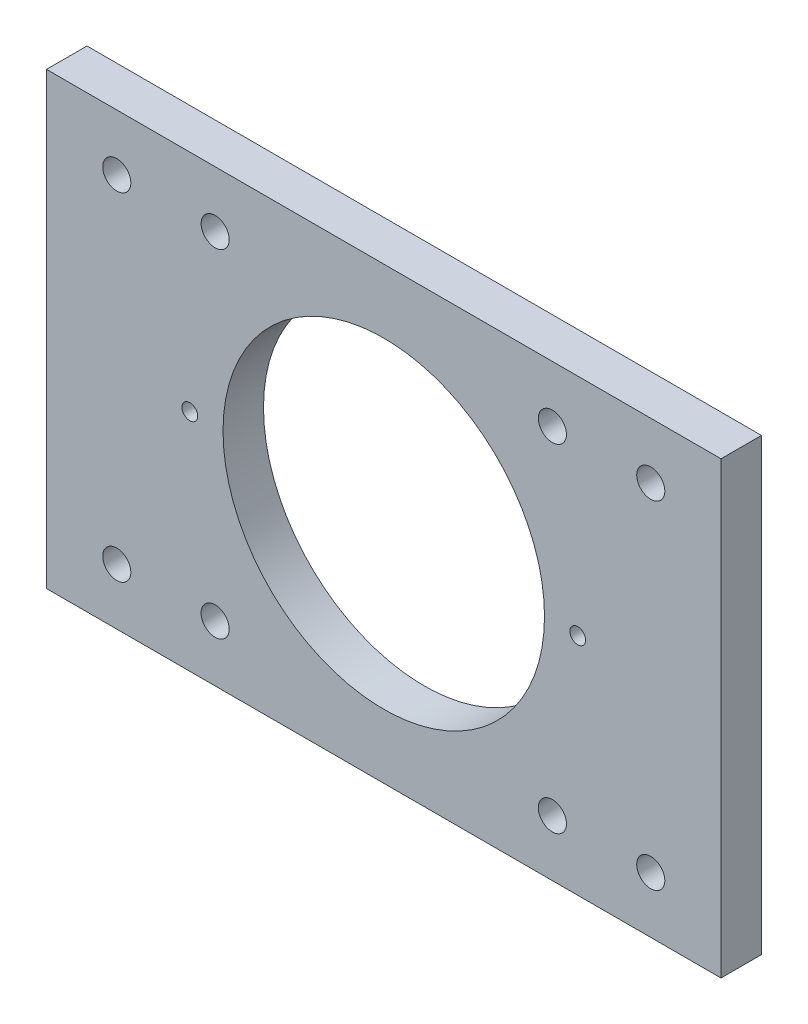
ISO-10303-21;
HEADER;
FILE_DESCRIPTION(('STEP AP214'),'2;1');
FILE_NAME('part.step','',(''),(''),'','','');
FILE_SCHEMA(('AUTOMOTIVE_DESIGN { 1 0 10303 214 1 1 1 1 }'));
ENDSEC;
DATA;
#1=APPLICATION_CONTEXT('core data for automotive mechanical design processes');
#2=APPLICATION_PROTOCOL_DEFINITION('international standard','automotive_design',2000,#1);
#3=PRODUCT_CONTEXT('',#1,'mechanical');
#4=PRODUCT('Part','Part','',(#3));
#5=PRODUCT_RELATED_PRODUCT_CATEGORY('part','',(#4));
#6=PRODUCT_DEFINITION_FORMATION('','',#4);
#7=PRODUCT_DEFINITION_CONTEXT('part definition',#1,'design');
#8=PRODUCT_DEFINITION('design','',#6,#7);
#9=PRODUCT_DEFINITION_SHAPE('','',#8);
#10=(LENGTH_UNIT() NAMED_UNIT(*) SI_UNIT(.MILLI.,.METRE.));
#11=(NAMED_UNIT(*) PLANE_ANGLE_UNIT() SI_UNIT($,.RADIAN.));
#12=(NAMED_UNIT(*) SI_UNIT($,.STERADIAN.) SOLID_ANGLE_UNIT());
#13=UNCERTAINTY_MEASURE_WITH_UNIT(LENGTH_MEASURE(1.E-05),#10,'distance_accuracy_value','');
#14=(GEOMETRIC_REPRESENTATION_CONTEXT(3) GLOBAL_UNCERTAINTY_ASSIGNED_CONTEXT((#13)) GLOBAL_UNIT_ASSIGNED_CONTEXT((#10,
#11,#12)) REPRESENTATION_CONTEXT('',''));
#15=CARTESIAN_POINT('',(0.,0.,0.));
#16=DIRECTION('',(0.,0.,1.));
#17=DIRECTION('',(1.,0.,0.));
#18=AXIS2_PLACEMENT_3D('',#15,#16,#17);
#19=CARTESIAN_POINT('',(0.,50.8,4.572));
#20=DIRECTION('',(0.,0.,-1.));
#21=DIRECTION('',(-1.,0.,0.));
#22=AXIS2_PLACEMENT_3D('',#19,#20,#21);
#23=PLANE('',#22);
#24=CARTESIAN_POINT('',(19.049999999999,6.35000000000002,4.572));
#25=DIRECTION('',(0.,0.,-1.));
#26=DIRECTION('',(-1.,0.,0.));
#27=AXIS2_PLACEMENT_3D('',#24,#25,#26);
#28=CIRCLE('',#27,1.58749999999898);
#29=CARTESIAN_POINT('',(17.4625,6.35000000000002,4.572));
#30=VERTEX_POINT('',#29);
#31=EDGE_CURVE('E284',#30,#30,#28,.T.);
#32=ORIENTED_EDGE('',*,*,#31,.T.);
#33=EDGE_LOOP('',(#32));
#34=FACE_BOUND('',#33,.T.);
#35=CARTESIAN_POINT('',(57.149999999999,6.35000000000004,4.572));
#36=DIRECTION('',(0.,0.,-1.));
#37=DIRECTION('',(-1.,0.,0.));
#38=AXIS2_PLACEMENT_3D('',#35,#36,#37);
#39=CIRCLE('',#38,1.58749999999913);
#40=CARTESIAN_POINT('',(55.5624999999999,6.35000000000004,4.572));
#41=VERTEX_POINT('',#40);
#42=EDGE_CURVE('E292',#41,#41,#39,.T.);
#43=ORIENTED_EDGE('',*,*,#42,.T.);
#44=EDGE_LOOP('',(#43));
#45=FACE_BOUND('',#44,.T.);
#46=CARTESIAN_POINT('',(57.1499999999983,44.4499999999999,4.572));
#47=DIRECTION('',(0.,0.,-1.));
#48=DIRECTION('',(-1.,0.,0.));
#49=AXIS2_PLACEMENT_3D('',#46,#47,#48);
#50=CIRCLE('',#49,1.58749999999899);
#51=CARTESIAN_POINT('',(55.5624999999993,44.4499999999999,4.572));
#52=VERTEX_POINT('',#51);
#53=EDGE_CURVE('E298',#52,#52,#50,.T.);
#54=ORIENTED_EDGE('',*,*,#53,.T.);
#55=EDGE_LOOP('',(#54));
#56=FACE_BOUND('',#55,.T.);
#57=CARTESIAN_POINT('',(19.049999999999,44.45,4.572));
#58=DIRECTION('',(0.,0.,-1.));
#59=DIRECTION('',(-1.,0.,0.));
#60=AXIS2_PLACEMENT_3D('',#57,#58,#59);
#61=CIRCLE('',#60,1.58749999999913);
#62=CARTESIAN_POINT('',(17.4624999999999,44.45,4.572));
#63=VERTEX_POINT('',#62);
#64=EDGE_CURVE('E135',#63,#63,#61,.T.);
#65=ORIENTED_EDGE('',*,*,#64,.T.);
#66=EDGE_LOOP('',(#65));
#67=FACE_BOUND('',#66,.T.);
#68=CARTESIAN_POINT('',(7.93750000000001,44.45,4.572));
#69=DIRECTION('',(0.,0.,1.));
#70=DIRECTION('',(1.,0.,0.));
#71=AXIS2_PLACEMENT_3D('',#68,#69,#70);
#72=CIRCLE('',#71,1.5875);
#73=CARTESIAN_POINT('',(9.52500000000001,44.45,4.572));
#74=VERTEX_POINT('',#73);
#75=EDGE_CURVE('E149',#74,#74,#72,.T.);
#76=ORIENTED_EDGE('',*,*,#75,.F.);
#77=EDGE_LOOP('',(#76));
#78=FACE_BOUND('',#77,.T.);
#79=CARTESIAN_POINT('',(68.2625,44.45,4.572));
#80=DIRECTION('',(0.,0.,-1.));
#81=DIRECTION('',(-1.,0.,0.));
#82=AXIS2_PLACEMENT_3D('',#79,#80,#81);
#83=CIRCLE('',#82,1.5875);
#84=CARTESIAN_POINT('',(66.675,44.45,4.572));
#85=VERTEX_POINT('',#84);
#86=EDGE_CURVE('E155',#85,#85,#83,.T.);
#87=ORIENTED_EDGE('',*,*,#86,.T.);
#88=EDGE_LOOP('',(#87));
#89=FACE_BOUND('',#88,.T.);
#90=CARTESIAN_POINT('',(16.1881750645913,25.4,4.572));
#91=DIRECTION('',(0.,0.,-1.));
#92=DIRECTION('',(-1.,0.,0.));
#93=AXIS2_PLACEMENT_3D('',#90,#91,#92);
#94=CIRCLE('',#93,0.888999999999999);
#95=CARTESIAN_POINT('',(15.2991750645913,25.4,4.572));
#96=VERTEX_POINT('',#95);
#97=EDGE_CURVE('E165',#96,#96,#94,.F.);
#98=ORIENTED_EDGE('',*,*,#97,.F.);
#99=EDGE_LOOP('',(#98));
#100=FACE_BOUND('',#99,.T.);
#101=DIRECTION('',(0.,-1.,0.));
#102=VECTOR('',#101,1.);
#103=CARTESIAN_POINT('',(0.,0.,4.572));
#104=LINE('',#103,#102);
#105=CARTESIAN_POINT('',(0.,50.8,4.572));
#106=VERTEX_POINT('',#105);
#107=CARTESIAN_POINT('',(0.,0.,4.572));
#108=VERTEX_POINT('',#107);
#109=EDGE_CURVE('E88',#106,#108,#104,.T.);
#110=ORIENTED_EDGE('',*,*,#109,.T.);
#111=DIRECTION('',(1.,0.,0.));
#112=VECTOR('',#111,1.);
#113=CARTESIAN_POINT('',(0.,0.,4.572));
#114=LINE('',#113,#112);
#115=CARTESIAN_POINT('',(76.2,0.,4.572));
#116=VERTEX_POINT('',#115);
#117=EDGE_CURVE('E83',#108,#116,#114,.T.);
#118=ORIENTED_EDGE('',*,*,#117,.T.);
#119=DIRECTION('',(0.,1.,0.));
#120=VECTOR('',#119,1.);
#121=CARTESIAN_POINT('',(76.2,0.,4.572));
#122=LINE('',#121,#120);
#123=CARTESIAN_POINT('',(76.2,50.8,4.572));
#124=VERTEX_POINT('',#123);
#125=EDGE_CURVE('E86',#116,#124,#122,.T.);
#126=ORIENTED_EDGE('',*,*,#125,.T.);
#127=DIRECTION('',(-1.,0.,0.));
#128=VECTOR('',#127,1.);
#129=CARTESIAN_POINT('',(0.,50.8,4.572));
#130=LINE('',#129,#128);
#131=EDGE_CURVE('E52',#124,#106,#130,.T.);
#132=ORIENTED_EDGE('',*,*,#131,.T.);
#133=EDGE_LOOP('',(#110,#118,#126,#132));
#134=FACE_BOUND('',#133,.T.);
#135=CARTESIAN_POINT('',(38.1,25.4,4.572));
#136=DIRECTION('',(0.,0.,-1.));
#137=DIRECTION('',(-1.,0.,0.));
#138=AXIS2_PLACEMENT_3D('',#135,#136,#137);
#139=CIRCLE('',#138,18.161);
#140=CARTESIAN_POINT('',(19.939,25.4,4.572));
#141=VERTEX_POINT('',#140);
#142=EDGE_CURVE('E162',#141,#141,#139,.F.);
#143=ORIENTED_EDGE('',*,*,#142,.F.);
#144=EDGE_LOOP('',(#143));
#145=FACE_BOUND('',#144,.T.);
#146=CARTESIAN_POINT('',(60.0118249354087,25.4,4.572));
#147=DIRECTION('',(0.,0.,-1.));
#148=DIRECTION('',(-1.,0.,0.));
#149=AXIS2_PLACEMENT_3D('',#146,#147,#148);
#150=CIRCLE('',#149,0.889000000000003);
#151=CARTESIAN_POINT('',(59.1228249354087,25.4,4.572));
#152=VERTEX_POINT('',#151);
#153=EDGE_CURVE('E105',#152,#152,#150,.F.);
#154=ORIENTED_EDGE('',*,*,#153,.F.);
#155=EDGE_LOOP('',(#154));
#156=FACE_BOUND('',#155,.T.);
#157=CARTESIAN_POINT('',(7.9375,6.35,4.572));
#158=DIRECTION('',(0.,0.,-1.));
#159=DIRECTION('',(1.,0.,0.));
#160=AXIS2_PLACEMENT_3D('',#157,#158,#159);
#161=CIRCLE('',#160,1.5875);
#162=CARTESIAN_POINT('',(9.525,6.35,4.572));
#163=VERTEX_POINT('',#162);
#164=EDGE_CURVE('E144',#163,#163,#161,.T.);
#165=ORIENTED_EDGE('',*,*,#164,.T.);
#166=EDGE_LOOP('',(#165));
#167=FACE_BOUND('',#166,.T.);
#168=CARTESIAN_POINT('',(68.2625,6.35,4.572));
#169=DIRECTION('',(0.,0.,1.));
#170=DIRECTION('',(-1.,0.,0.));
#171=AXIS2_PLACEMENT_3D('',#168,#169,#170);
#172=CIRCLE('',#171,1.5875);
#173=CARTESIAN_POINT('',(66.675,6.35,4.572));
#174=VERTEX_POINT('',#173);
#175=EDGE_CURVE('E134',#174,#174,#172,.T.);
#176=ORIENTED_EDGE('',*,*,#175,.F.);
#177=EDGE_LOOP('',(#176));
#178=FACE_BOUND('',#177,.T.);
#179=ADVANCED_FACE('F35',(#34,#45,#56,#67,#78,#89,#100,#134,#145,#156,#167,#178),#23,.F.);
#180=CARTESIAN_POINT('',(0.,50.8,0.));
#181=DIRECTION('',(0.,0.,-1.));
#182=DIRECTION('',(-1.,0.,0.));
#183=AXIS2_PLACEMENT_3D('',#180,#181,#182);
#184=PLANE('',#183);
#185=CARTESIAN_POINT('',(19.049999999999,6.35000000000002,0.));
#186=DIRECTION('',(0.,0.,-1.));
#187=DIRECTION('',(-1.,0.,0.));
#188=AXIS2_PLACEMENT_3D('',#185,#186,#187);
#189=CIRCLE('',#188,1.58749999999898);
#190=CARTESIAN_POINT('',(17.4625,6.35000000000002,0.));
#191=VERTEX_POINT('',#190);
#192=EDGE_CURVE('E287',#191,#191,#189,.T.);
#193=ORIENTED_EDGE('',*,*,#192,.F.);
#194=EDGE_LOOP('',(#193));
#195=FACE_BOUND('',#194,.T.);
#196=CARTESIAN_POINT('',(57.149999999999,6.35000000000004,0.));
#197=DIRECTION('',(0.,0.,-1.));
#198=DIRECTION('',(-1.,0.,0.));
#199=AXIS2_PLACEMENT_3D('',#196,#197,#198);
#200=CIRCLE('',#199,1.58749999999913);
#201=CARTESIAN_POINT('',(55.5624999999999,6.35000000000004,0.));
#202=VERTEX_POINT('',#201);
#203=EDGE_CURVE('E289',#202,#202,#200,.T.);
#204=ORIENTED_EDGE('',*,*,#203,.F.);
#205=EDGE_LOOP('',(#204));
#206=FACE_BOUND('',#205,.T.);
#207=CARTESIAN_POINT('',(57.1499999999983,44.4499999999999,0.));
#208=DIRECTION('',(0.,0.,-1.));
#209=DIRECTION('',(-1.,0.,0.));
#210=AXIS2_PLACEMENT_3D('',#207,#208,#209);
#211=CIRCLE('',#210,1.58749999999899);
#212=CARTESIAN_POINT('',(55.5624999999993,44.4499999999999,0.));
#213=VERTEX_POINT('',#212);
#214=EDGE_CURVE('E295',#213,#213,#211,.T.);
#215=ORIENTED_EDGE('',*,*,#214,.F.);
#216=EDGE_LOOP('',(#215));
#217=FACE_BOUND('',#216,.T.);
#218=CARTESIAN_POINT('',(19.049999999999,44.45,0.));
#219=DIRECTION('',(0.,0.,-1.));
#220=DIRECTION('',(-1.,0.,0.));
#221=AXIS2_PLACEMENT_3D('',#218,#219,#220);
#222=CIRCLE('',#221,1.58749999999913);
#223=CARTESIAN_POINT('',(17.4624999999999,44.45,0.));
#224=VERTEX_POINT('',#223);
#225=EDGE_CURVE('E140',#224,#224,#222,.T.);
#226=ORIENTED_EDGE('',*,*,#225,.F.);
#227=EDGE_LOOP('',(#226));
#228=FACE_BOUND('',#227,.T.);
#229=CARTESIAN_POINT('',(7.93750000000001,44.45,0.));
#230=DIRECTION('',(0.,0.,1.));
#231=DIRECTION('',(1.,0.,0.));
#232=AXIS2_PLACEMENT_3D('',#229,#230,#231);
#233=CIRCLE('',#232,1.5875);
#234=CARTESIAN_POINT('',(9.52500000000001,44.45,0.));
#235=VERTEX_POINT('',#234);
#236=EDGE_CURVE('E147',#235,#235,#233,.T.);
#237=ORIENTED_EDGE('',*,*,#236,.T.);
#238=EDGE_LOOP('',(#237));
#239=FACE_BOUND('',#238,.T.);
#240=CARTESIAN_POINT('',(68.2625,44.45,0.));
#241=DIRECTION('',(0.,0.,-1.));
#242=DIRECTION('',(-1.,0.,0.));
#243=AXIS2_PLACEMENT_3D('',#240,#241,#242);
#244=CIRCLE('',#243,1.5875);
#245=CARTESIAN_POINT('',(66.675,44.45,0.));
#246=VERTEX_POINT('',#245);
#247=EDGE_CURVE('E152',#246,#246,#244,.T.);
#248=ORIENTED_EDGE('',*,*,#247,.F.);
#249=EDGE_LOOP('',(#248));
#250=FACE_BOUND('',#249,.T.);
#251=CARTESIAN_POINT('',(38.1,25.4,0.));
#252=DIRECTION('',(0.,0.,-1.));
#253=DIRECTION('',(-1.,0.,0.));
#254=AXIS2_PLACEMENT_3D('',#251,#252,#253);
#255=CIRCLE('',#254,18.161);
#256=CARTESIAN_POINT('',(19.939,25.4,0.));
#257=VERTEX_POINT('',#256);
#258=EDGE_CURVE('E11',#257,#257,#255,.F.);
#259=ORIENTED_EDGE('',*,*,#258,.T.);
#260=EDGE_LOOP('',(#259));
#261=FACE_BOUND('',#260,.T.);
#262=DIRECTION('',(0.,-1.,0.));
#263=VECTOR('',#262,1.);
#264=CARTESIAN_POINT('',(0.,0.,0.));
#265=LINE('',#264,#263);
#266=CARTESIAN_POINT('',(0.,50.8,0.));
#267=VERTEX_POINT('',#266);
#268=CARTESIAN_POINT('',(0.,0.,0.));
#269=VERTEX_POINT('',#268);
#270=EDGE_CURVE('E102',#267,#269,#265,.T.);
#271=ORIENTED_EDGE('',*,*,#270,.F.);
#272=DIRECTION('',(-1.,0.,0.));
#273=VECTOR('',#272,1.);
#274=CARTESIAN_POINT('',(0.,50.8,0.));
#275=LINE('',#274,#273);
#276=CARTESIAN_POINT('',(76.2,50.8,0.));
#277=VERTEX_POINT('',#276);
#278=EDGE_CURVE('E75',#277,#267,#275,.T.);
#279=ORIENTED_EDGE('',*,*,#278,.F.);
#280=DIRECTION('',(0.,1.,0.));
#281=VECTOR('',#280,1.);
#282=CARTESIAN_POINT('',(76.2,0.,0.));
#283=LINE('',#282,#281);
#284=CARTESIAN_POINT('',(76.2,0.,0.));
#285=VERTEX_POINT('',#284);
#286=EDGE_CURVE('E69',#285,#277,#283,.T.);
#287=ORIENTED_EDGE('',*,*,#286,.F.);
#288=DIRECTION('',(1.,0.,0.));
#289=VECTOR('',#288,1.);
#290=CARTESIAN_POINT('',(0.,0.,0.));
#291=LINE('',#290,#289);
#292=EDGE_CURVE('E93',#269,#285,#291,.T.);
#293=ORIENTED_EDGE('',*,*,#292,.F.);
#294=EDGE_LOOP('',(#271,#279,#287,#293));
#295=FACE_BOUND('',#294,.T.);
#296=CARTESIAN_POINT('',(60.0118249354087,25.4,0.));
#297=DIRECTION('',(0.,0.,1.));
#298=DIRECTION('',(0.707106781186548,-0.707106781186548,0.));
#299=AXIS2_PLACEMENT_3D('',#296,#297,#298);
#300=CIRCLE('',#299,0.889000000000003);
#301=CARTESIAN_POINT('',(60.6404428638835,24.7713820715252,0.));
#302=VERTEX_POINT('',#301);
#303=EDGE_CURVE('E121',#302,#302,#300,.T.);
#304=ORIENTED_EDGE('',*,*,#303,.T.);
#305=EDGE_LOOP('',(#304));
#306=FACE_BOUND('',#305,.T.);
#307=CARTESIAN_POINT('',(16.1881750645913,25.4,0.));
#308=DIRECTION('',(0.,0.,1.));
#309=DIRECTION('',(0.707106781186548,-0.707106781186548,0.));
#310=AXIS2_PLACEMENT_3D('',#307,#308,#309);
#311=CIRCLE('',#310,0.888999999999999);
#312=CARTESIAN_POINT('',(16.8167929930661,24.7713820715251,0.));
#313=VERTEX_POINT('',#312);
#314=EDGE_CURVE('E125',#313,#313,#311,.T.);
#315=ORIENTED_EDGE('',*,*,#314,.T.);
#316=EDGE_LOOP('',(#315));
#317=FACE_BOUND('',#316,.T.);
#318=CARTESIAN_POINT('',(7.9375,6.35,0.));
#319=DIRECTION('',(0.,0.,-1.));
#320=DIRECTION('',(1.,0.,0.));
#321=AXIS2_PLACEMENT_3D('',#318,#319,#320);
#322=CIRCLE('',#321,1.5875);
#323=CARTESIAN_POINT('',(9.525,6.35,0.));
#324=VERTEX_POINT('',#323);
#325=EDGE_CURVE('E129',#324,#324,#322,.T.);
#326=ORIENTED_EDGE('',*,*,#325,.F.);
#327=EDGE_LOOP('',(#326));
#328=FACE_BOUND('',#327,.T.);
#329=CARTESIAN_POINT('',(68.2625,6.35,0.));
#330=DIRECTION('',(0.,0.,1.));
#331=DIRECTION('',(-1.,0.,0.));
#332=AXIS2_PLACEMENT_3D('',#329,#330,#331);
#333=CIRCLE('',#332,1.5875);
#334=CARTESIAN_POINT('',(66.675,6.35,0.));
#335=VERTEX_POINT('',#334);
#336=EDGE_CURVE('E132',#335,#335,#333,.T.);
#337=ORIENTED_EDGE('',*,*,#336,.T.);
#338=EDGE_LOOP('',(#337));
#339=FACE_BOUND('',#338,.T.);
#340=ADVANCED_FACE('F113',(#195,#206,#217,#228,#239,#250,#261,#295,#306,#317,#328,#339),#184,.T.);
#341=CARTESIAN_POINT('',(0.,0.,4.572));
#342=DIRECTION('',(1.,0.,0.));
#343=DIRECTION('',(0.,1.,0.));
#344=AXIS2_PLACEMENT_3D('',#341,#342,#343);
#345=PLANE('',#344);
#346=ORIENTED_EDGE('',*,*,#270,.T.);
#347=DIRECTION('',(0.,0.,-1.));
#348=VECTOR('',#347,1.);
#349=CARTESIAN_POINT('',(0.,0.,4.572));
#350=LINE('',#349,#348);
#351=EDGE_CURVE('E44',#108,#269,#350,.T.);
#352=ORIENTED_EDGE('',*,*,#351,.F.);
#353=ORIENTED_EDGE('',*,*,#109,.F.);
#354=DIRECTION('',(0.,0.,-1.));
#355=VECTOR('',#354,1.);
#356=CARTESIAN_POINT('',(0.,50.8,4.572));
#357=LINE('',#356,#355);
#358=EDGE_CURVE('E98',#106,#267,#357,.T.);
#359=ORIENTED_EDGE('',*,*,#358,.T.);
#360=EDGE_LOOP('',(#346,#352,#353,#359));
#361=FACE_BOUND('',#360,.T.);
#362=ADVANCED_FACE('F37',(#361),#345,.F.);
#363=CARTESIAN_POINT('',(0.,0.,4.572));
#364=DIRECTION('',(0.,1.,0.));
#365=DIRECTION('',(0.,0.,1.));
#366=AXIS2_PLACEMENT_3D('',#363,#364,#365);
#367=PLANE('',#366);
#368=ORIENTED_EDGE('',*,*,#292,.T.);
#369=DIRECTION('',(0.,0.,-1.));
#370=VECTOR('',#369,1.);
#371=CARTESIAN_POINT('',(76.2,0.,4.572));
#372=LINE('',#371,#370);
#373=EDGE_CURVE('E91',#116,#285,#372,.T.);
#374=ORIENTED_EDGE('',*,*,#373,.F.);
#375=ORIENTED_EDGE('',*,*,#117,.F.);
#376=ORIENTED_EDGE('',*,*,#351,.T.);
#377=EDGE_LOOP('',(#368,#374,#375,#376));
#378=FACE_BOUND('',#377,.T.);
#379=ADVANCED_FACE('F92',(#378),#367,.F.);
#380=CARTESIAN_POINT('',(76.2,0.,4.572));
#381=DIRECTION('',(-1.,0.,0.));
#382=DIRECTION('',(0.,-1.,0.));
#383=AXIS2_PLACEMENT_3D('',#380,#381,#382);
#384=PLANE('',#383);
#385=ORIENTED_EDGE('',*,*,#286,.T.);
#386=DIRECTION('',(0.,0.,-1.));
#387=VECTOR('',#386,1.);
#388=CARTESIAN_POINT('',(76.2,50.8,4.572));
#389=LINE('',#388,#387);
#390=EDGE_CURVE('E94',#124,#277,#389,.T.);
#391=ORIENTED_EDGE('',*,*,#390,.F.);
#392=ORIENTED_EDGE('',*,*,#125,.F.);
#393=ORIENTED_EDGE('',*,*,#373,.T.);
#394=EDGE_LOOP('',(#385,#391,#392,#393));
#395=FACE_BOUND('',#394,.T.);
#396=ADVANCED_FACE('F96',(#395),#384,.F.);
#397=CARTESIAN_POINT('',(0.,50.8,4.572));
#398=DIRECTION('',(0.,-1.,0.));
#399=DIRECTION('',(0.,0.,-1.));
#400=AXIS2_PLACEMENT_3D('',#397,#398,#399);
#401=PLANE('',#400);
#402=ORIENTED_EDGE('',*,*,#278,.T.);
#403=ORIENTED_EDGE('',*,*,#358,.F.);
#404=ORIENTED_EDGE('',*,*,#131,.F.);
#405=ORIENTED_EDGE('',*,*,#390,.T.);
#406=EDGE_LOOP('',(#402,#403,#404,#405));
#407=FACE_BOUND('',#406,.T.);
#408=ADVANCED_FACE('F209',(#407),#401,.F.);
#409=CARTESIAN_POINT('',(38.1,25.4,-2.54));
#410=DIRECTION('',(0.,0.,1.));
#411=DIRECTION('',(0.707106781186548,-0.707106781186548,0.));
#412=AXIS2_PLACEMENT_3D('',#409,#410,#411);
#413=CYLINDRICAL_SURFACE('',#412,18.161);
#414=ORIENTED_EDGE('',*,*,#258,.F.);
#415=EDGE_LOOP('',(#414));
#416=FACE_BOUND('',#415,.T.);
#417=ORIENTED_EDGE('',*,*,#142,.T.);
#418=EDGE_LOOP('',(#417));
#419=FACE_BOUND('',#418,.T.);
#420=ADVANCED_FACE('F205',(#416,#419),#413,.F.);
#421=CARTESIAN_POINT('',(16.1881750645913,25.4,25.4));
#422=DIRECTION('',(0.,0.,-1.));
#423=DIRECTION('',(-0.707106781186548,0.707106781186548,0.));
#424=AXIS2_PLACEMENT_3D('',#421,#422,#423);
#425=CYLINDRICAL_SURFACE('',#424,0.888999999999999);
#426=ORIENTED_EDGE('',*,*,#314,.F.);
#427=EDGE_LOOP('',(#426));
#428=FACE_BOUND('',#427,.T.);
#429=ORIENTED_EDGE('',*,*,#97,.T.);
#430=EDGE_LOOP('',(#429));
#431=FACE_BOUND('',#430,.T.);
#432=ADVANCED_FACE('F208',(#428,#431),#425,.F.);
#433=CARTESIAN_POINT('',(60.0118249354087,25.4,25.4));
#434=DIRECTION('',(0.,0.,-1.));
#435=DIRECTION('',(-0.707106781186548,0.707106781186548,0.));
#436=AXIS2_PLACEMENT_3D('',#433,#434,#435);
#437=CYLINDRICAL_SURFACE('',#436,0.889000000000003);
#438=ORIENTED_EDGE('',*,*,#303,.F.);
#439=EDGE_LOOP('',(#438));
#440=FACE_BOUND('',#439,.T.);
#441=ORIENTED_EDGE('',*,*,#153,.T.);
#442=EDGE_LOOP('',(#441));
#443=FACE_BOUND('',#442,.T.);
#444=ADVANCED_FACE('F171',(#440,#443),#437,.F.);
#445=CARTESIAN_POINT('',(68.2625,44.45,4.572));
#446=DIRECTION('',(0.,0.,-1.));
#447=DIRECTION('',(-1.,0.,0.));
#448=AXIS2_PLACEMENT_3D('',#445,#446,#447);
#449=CYLINDRICAL_SURFACE('',#448,1.5875);
#450=ORIENTED_EDGE('',*,*,#86,.F.);
#451=EDGE_LOOP('',(#450));
#452=FACE_BOUND('',#451,.T.);
#453=ORIENTED_EDGE('',*,*,#247,.T.);
#454=EDGE_LOOP('',(#453));
#455=FACE_BOUND('',#454,.T.);
#456=ADVANCED_FACE('F200',(#452,#455),#449,.F.);
#457=CARTESIAN_POINT('',(7.93750000000001,44.45,4.572));
#458=DIRECTION('',(0.,0.,-1.));
#459=DIRECTION('',(-1.,0.,0.));
#460=AXIS2_PLACEMENT_3D('',#457,#458,#459);
#461=CYLINDRICAL_SURFACE('',#460,1.5875);
#462=ORIENTED_EDGE('',*,*,#75,.T.);
#463=EDGE_LOOP('',(#462));
#464=FACE_BOUND('',#463,.T.);
#465=ORIENTED_EDGE('',*,*,#236,.F.);
#466=EDGE_LOOP('',(#465));
#467=FACE_BOUND('',#466,.T.);
#468=ADVANCED_FACE('F193',(#464,#467),#461,.F.);
#469=CARTESIAN_POINT('',(7.9375,6.35,4.572));
#470=DIRECTION('',(0.,0.,-1.));
#471=DIRECTION('',(-1.,0.,0.));
#472=AXIS2_PLACEMENT_3D('',#469,#470,#471);
#473=CYLINDRICAL_SURFACE('',#472,1.5875);
#474=ORIENTED_EDGE('',*,*,#164,.F.);
#475=EDGE_LOOP('',(#474));
#476=FACE_BOUND('',#475,.T.);
#477=ORIENTED_EDGE('',*,*,#325,.T.);
#478=EDGE_LOOP('',(#477));
#479=FACE_BOUND('',#478,.T.);
#480=ADVANCED_FACE('F184',(#476,#479),#473,.F.);
#481=CARTESIAN_POINT('',(68.2625,6.35,4.572));
#482=DIRECTION('',(0.,0.,-1.));
#483=DIRECTION('',(-1.,0.,0.));
#484=AXIS2_PLACEMENT_3D('',#481,#482,#483);
#485=CYLINDRICAL_SURFACE('',#484,1.5875);
#486=ORIENTED_EDGE('',*,*,#175,.T.);
#487=EDGE_LOOP('',(#486));
#488=FACE_BOUND('',#487,.T.);
#489=ORIENTED_EDGE('',*,*,#336,.F.);
#490=EDGE_LOOP('',(#489));
#491=FACE_BOUND('',#490,.T.);
#492=ADVANCED_FACE('F181',(#488,#491),#485,.F.);
#493=CARTESIAN_POINT('',(19.049999999999,44.45,4.572));
#494=DIRECTION('',(0.,0.,-1.));
#495=DIRECTION('',(-1.,0.,0.));
#496=AXIS2_PLACEMENT_3D('',#493,#494,#495);
#497=CYLINDRICAL_SURFACE('',#496,1.58749999999913);
#498=ORIENTED_EDGE('',*,*,#64,.F.);
#499=EDGE_LOOP('',(#498));
#500=FACE_BOUND('',#499,.T.);
#501=ORIENTED_EDGE('',*,*,#225,.T.);
#502=EDGE_LOOP('',(#501));
#503=FACE_BOUND('',#502,.T.);
#504=ADVANCED_FACE('F183',(#500,#503),#497,.F.);
#505=CARTESIAN_POINT('',(57.1499999999983,44.4499999999999,4.572));
#506=DIRECTION('',(0.,0.,-1.));
#507=DIRECTION('',(-1.,0.,0.));
#508=AXIS2_PLACEMENT_3D('',#505,#506,#507);
#509=CYLINDRICAL_SURFACE('',#508,1.58749999999899);
#510=ORIENTED_EDGE('',*,*,#53,.F.);
#511=EDGE_LOOP('',(#510));
#512=FACE_BOUND('',#511,.T.);
#513=ORIENTED_EDGE('',*,*,#214,.T.);
#514=EDGE_LOOP('',(#513));
#515=FACE_BOUND('',#514,.T.);
#516=ADVANCED_FACE('F190',(#512,#515),#509,.F.);
#517=CARTESIAN_POINT('',(57.149999999999,6.35000000000004,4.572));
#518=DIRECTION('',(0.,0.,-1.));
#519=DIRECTION('',(-1.,0.,0.));
#520=AXIS2_PLACEMENT_3D('',#517,#518,#519);
#521=CYLINDRICAL_SURFACE('',#520,1.58749999999913);
#522=ORIENTED_EDGE('',*,*,#42,.F.);
#523=EDGE_LOOP('',(#522));
#524=FACE_BOUND('',#523,.T.);
#525=ORIENTED_EDGE('',*,*,#203,.T.);
#526=EDGE_LOOP('',(#525));
#527=FACE_BOUND('',#526,.T.);
#528=ADVANCED_FACE('F258',(#524,#527),#521,.F.);
#529=CARTESIAN_POINT('',(19.049999999999,6.35000000000002,4.572));
#530=DIRECTION('',(0.,0.,-1.));
#531=DIRECTION('',(-1.,0.,0.));
#532=AXIS2_PLACEMENT_3D('',#529,#530,#531);
#533=CYLINDRICAL_SURFACE('',#532,1.58749999999898);
#534=ORIENTED_EDGE('',*,*,#31,.F.);
#535=EDGE_LOOP('',(#534));
#536=FACE_BOUND('',#535,.T.);
#537=ORIENTED_EDGE('',*,*,#192,.T.);
#538=EDGE_LOOP('',(#537));
#539=FACE_BOUND('',#538,.T.);
#540=ADVANCED_FACE('F267',(#536,#539),#533,.F.);
#541=CLOSED_SHELL('',(#179,#340,#362,#379,#396,#408,#420,#432,#444,#456,#468,#480,#492,#504,
#516,#528,#540));
#542=MANIFOLD_SOLID_BREP('B2',#541);
#543=ADVANCED_BREP_SHAPE_REPRESENTATION('',(#18,#542),#14);
#544=SHAPE_DEFINITION_REPRESENTATION(#9,#543);
ENDSEC;
END-ISO-10303-21;
